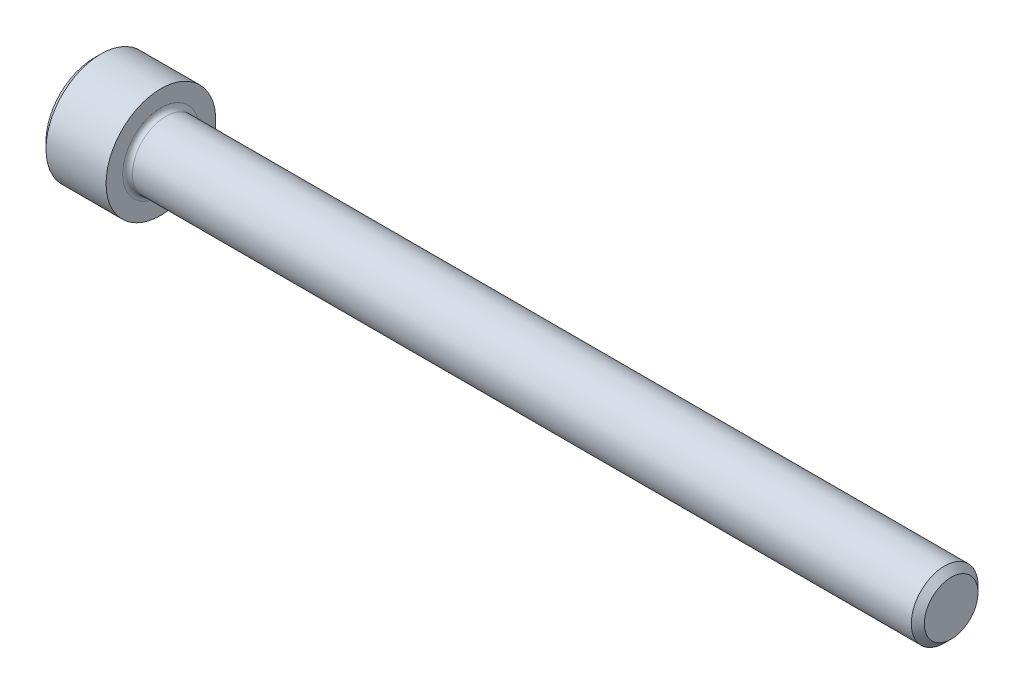
ISO-10303-21;
HEADER;
FILE_DESCRIPTION(('STEP AP214'),'2;1');
FILE_NAME('part.step','',(''),(''),'','','');
FILE_SCHEMA(('AUTOMOTIVE_DESIGN { 1 0 10303 214 1 1 1 1 }'));
ENDSEC;
DATA;
#1=APPLICATION_CONTEXT('core data for automotive mechanical design processes');
#2=APPLICATION_PROTOCOL_DEFINITION('international standard','automotive_design',2000,#1);
#3=PRODUCT_CONTEXT('',#1,'mechanical');
#4=PRODUCT('Part','Part','',(#3));
#5=PRODUCT_RELATED_PRODUCT_CATEGORY('part','',(#4));
#6=PRODUCT_DEFINITION_FORMATION('','',#4);
#7=PRODUCT_DEFINITION_CONTEXT('part definition',#1,'design');
#8=PRODUCT_DEFINITION('design','',#6,#7);
#9=PRODUCT_DEFINITION_SHAPE('','',#8);
#10=(LENGTH_UNIT() NAMED_UNIT(*) SI_UNIT(.MILLI.,.METRE.));
#11=(NAMED_UNIT(*) PLANE_ANGLE_UNIT() SI_UNIT($,.RADIAN.));
#12=(NAMED_UNIT(*) SI_UNIT($,.STERADIAN.) SOLID_ANGLE_UNIT());
#13=UNCERTAINTY_MEASURE_WITH_UNIT(LENGTH_MEASURE(1.E-05),#10,'distance_accuracy_value','');
#14=(GEOMETRIC_REPRESENTATION_CONTEXT(3) GLOBAL_UNCERTAINTY_ASSIGNED_CONTEXT((#13)) GLOBAL_UNIT_ASSIGNED_CONTEXT((#10,
#11,#12)) REPRESENTATION_CONTEXT('',''));
#15=CARTESIAN_POINT('',(0.,0.,0.));
#16=DIRECTION('',(0.,0.,1.));
#17=DIRECTION('',(1.,0.,0.));
#18=AXIS2_PLACEMENT_3D('',#15,#16,#17);
#19=CARTESIAN_POINT('',(2.286,1.14604605784412,1.98501000000003));
#20=DIRECTION('',(-1.,0.,0.));
#21=DIRECTION('',(0.,0.,1.));
#22=AXIS2_PLACEMENT_3D('',#19,#20,#21);
#23=PLANE('',#22);
#24=DIRECTION('',(0.,0.499999999999999,0.866025403784439));
#25=VECTOR('',#24,1.);
#26=CARTESIAN_POINT('',(2.286,-1.71906908676612,0.992505000000032));
#27=LINE('',#26,#25);
#28=CARTESIAN_POINT('',(2.28600000001322,-1.71906908676548,0.992504999999662));
#29=VERTEX_POINT('',#28);
#30=CARTESIAN_POINT('',(2.286,-1.14604605784409,1.98501));
#31=VERTEX_POINT('',#30);
#32=EDGE_CURVE('E100',#29,#31,#27,.T.);
#33=ORIENTED_EDGE('',*,*,#32,.T.);
#34=DIRECTION('',(0.,1.,0.));
#35=VECTOR('',#34,1.);
#36=CARTESIAN_POINT('',(2.286,1.14604605784412,1.98501));
#37=LINE('',#36,#35);
#38=CARTESIAN_POINT('',(2.28599999999801,0.,1.98501000002693));
#39=VERTEX_POINT('',#38);
#40=EDGE_CURVE('E95',#31,#39,#37,.T.);
#41=ORIENTED_EDGE('',*,*,#40,.T.);
#42=CARTESIAN_POINT('',(2.28600000002643,0.,0.));
#43=DIRECTION('',(-1.,0.,0.));
#44=DIRECTION('',(0.,0.,1.));
#45=AXIS2_PLACEMENT_3D('',#42,#43,#44);
#46=CIRCLE('',#45,1.98500999999851);
#47=EDGE_CURVE('E97',#39,#29,#46,.F.);
#48=ORIENTED_EDGE('',*,*,#47,.T.);
#49=EDGE_LOOP('',(#33,#41,#48));
#50=FACE_BOUND('',#49,.T.);
#51=ADVANCED_FACE('F17',(#50),#23,.T.);
#52=CARTESIAN_POINT('',(2.286,1.14604605784412,1.98501000000003));
#53=DIRECTION('',(-1.,0.,0.));
#54=DIRECTION('',(0.,0.,1.));
#55=AXIS2_PLACEMENT_3D('',#52,#53,#54);
#56=PLANE('',#55);
#57=DIRECTION('',(0.,-0.499999999999978,0.866025403784451));
#58=VECTOR('',#57,1.);
#59=CARTESIAN_POINT('',(2.286,-1.71906908676615,-0.992504999999998));
#60=LINE('',#59,#58);
#61=CARTESIAN_POINT('',(2.28600000001322,-1.7190690867655,-0.992504999999627));
#62=VERTEX_POINT('',#61);
#63=CARTESIAN_POINT('',(2.286,-2.2920921156882,0.));
#64=VERTEX_POINT('',#63);
#65=EDGE_CURVE('E104',#62,#64,#60,.T.);
#66=ORIENTED_EDGE('',*,*,#65,.T.);
#67=DIRECTION('',(0.,0.500000000000031,0.866025403784421));
#68=VECTOR('',#67,1.);
#69=CARTESIAN_POINT('',(2.286,-2.2920921156882,0.));
#70=LINE('',#69,#68);
#71=EDGE_CURVE('E171',#64,#29,#70,.T.);
#72=ORIENTED_EDGE('',*,*,#71,.T.);
#73=CARTESIAN_POINT('',(2.28600000002643,0.,0.));
#74=DIRECTION('',(-1.,0.,0.));
#75=DIRECTION('',(0.,0.,1.));
#76=AXIS2_PLACEMENT_3D('',#73,#74,#75);
#77=CIRCLE('',#76,1.98500999999851);
#78=EDGE_CURVE('E116',#29,#62,#77,.F.);
#79=ORIENTED_EDGE('',*,*,#78,.T.);
#80=EDGE_LOOP('',(#66,#72,#79));
#81=FACE_BOUND('',#80,.T.);
#82=ADVANCED_FACE('F228',(#81),#56,.T.);
#83=CARTESIAN_POINT('',(2.286,1.14604605784412,1.98501000000003));
#84=DIRECTION('',(-1.,0.,0.));
#85=DIRECTION('',(0.,0.,1.));
#86=AXIS2_PLACEMENT_3D('',#83,#84,#85);
#87=PLANE('',#86);
#88=DIRECTION('',(0.,1.,0.));
#89=VECTOR('',#88,1.);
#90=CARTESIAN_POINT('',(2.286,1.14604605784412,-1.98500999999998));
#91=LINE('',#90,#89);
#92=CARTESIAN_POINT('',(2.28600000002082,-3.05260855546239E-12,-1.98500999995698));
#93=VERTEX_POINT('',#92);
#94=CARTESIAN_POINT('',(2.286,-1.1460460578441,-1.98500999999998));
#95=VERTEX_POINT('',#94);
#96=EDGE_CURVE('E166',#93,#95,#91,.F.);
#97=ORIENTED_EDGE('',*,*,#96,.T.);
#98=DIRECTION('',(0.,-0.500000000000002,0.866025403784438));
#99=VECTOR('',#98,1.);
#100=CARTESIAN_POINT('',(2.286,-1.1460460578441,-1.98501));
#101=LINE('',#100,#99);
#102=EDGE_CURVE('E161',#95,#62,#101,.T.);
#103=ORIENTED_EDGE('',*,*,#102,.T.);
#104=CARTESIAN_POINT('',(2.28600000002643,0.,0.));
#105=DIRECTION('',(-1.,0.,0.));
#106=DIRECTION('',(0.,0.,1.));
#107=AXIS2_PLACEMENT_3D('',#104,#105,#106);
#108=CIRCLE('',#107,1.98500999999851);
#109=EDGE_CURVE('E224',#62,#93,#108,.F.);
#110=ORIENTED_EDGE('',*,*,#109,.T.);
#111=EDGE_LOOP('',(#97,#103,#110));
#112=FACE_BOUND('',#111,.T.);
#113=ADVANCED_FACE('F230',(#112),#87,.T.);
#114=CARTESIAN_POINT('',(2.286,1.14604605784412,1.98501000000003));
#115=DIRECTION('',(-1.,0.,0.));
#116=DIRECTION('',(0.,0.,1.));
#117=AXIS2_PLACEMENT_3D('',#114,#115,#116);
#118=PLANE('',#117);
#119=DIRECTION('',(0.,-0.499999999999991,-0.866025403784444));
#120=VECTOR('',#119,1.);
#121=CARTESIAN_POINT('',(2.286,1.71906908676615,-0.992504999999987));
#122=LINE('',#121,#120);
#123=CARTESIAN_POINT('',(2.28600000001321,1.71906908676551,-0.992504999999615));
#124=VERTEX_POINT('',#123);
#125=CARTESIAN_POINT('',(2.286,1.14604605784411,-1.98501));
#126=VERTEX_POINT('',#125);
#127=EDGE_CURVE('E156',#124,#126,#122,.T.);
#128=ORIENTED_EDGE('',*,*,#127,.T.);
#129=DIRECTION('',(0.,1.,0.));
#130=VECTOR('',#129,1.);
#131=CARTESIAN_POINT('',(2.286,1.14604605784412,-1.98501));
#132=LINE('',#131,#130);
#133=EDGE_CURVE('E151',#126,#93,#132,.F.);
#134=ORIENTED_EDGE('',*,*,#133,.T.);
#135=CARTESIAN_POINT('',(2.28600000002643,0.,0.));
#136=DIRECTION('',(-1.,0.,0.));
#137=DIRECTION('',(0.,0.,1.));
#138=AXIS2_PLACEMENT_3D('',#135,#136,#137);
#139=CIRCLE('',#138,1.98500999999851);
#140=EDGE_CURVE('E221',#93,#124,#139,.F.);
#141=ORIENTED_EDGE('',*,*,#140,.T.);
#142=EDGE_LOOP('',(#128,#134,#141));
#143=FACE_BOUND('',#142,.T.);
#144=ADVANCED_FACE('F235',(#143),#118,.T.);
#145=CARTESIAN_POINT('',(2.286,1.14604605784412,1.98501000000003));
#146=DIRECTION('',(-1.,0.,0.));
#147=DIRECTION('',(0.,0.,1.));
#148=AXIS2_PLACEMENT_3D('',#145,#146,#147);
#149=PLANE('',#148);
#150=DIRECTION('',(0.,0.500000000000002,-0.866025403784437));
#151=VECTOR('',#150,1.);
#152=CARTESIAN_POINT('',(2.286,1.71906908676615,0.992504999999998));
#153=LINE('',#152,#151);
#154=CARTESIAN_POINT('',(2.28600000001321,1.71906908676551,0.992504999999624));
#155=VERTEX_POINT('',#154);
#156=CARTESIAN_POINT('',(2.286,2.2920921156882,0.));
#157=VERTEX_POINT('',#156);
#158=EDGE_CURVE('E146',#155,#157,#153,.T.);
#159=ORIENTED_EDGE('',*,*,#158,.T.);
#160=DIRECTION('',(0.,-0.500000000000006,-0.866025403784435));
#161=VECTOR('',#160,1.);
#162=CARTESIAN_POINT('',(2.286,2.2920921156882,0.));
#163=LINE('',#162,#161);
#164=EDGE_CURVE('E117',#157,#124,#163,.T.);
#165=ORIENTED_EDGE('',*,*,#164,.T.);
#166=CARTESIAN_POINT('',(2.28600000002643,0.,0.));
#167=DIRECTION('',(-1.,0.,0.));
#168=DIRECTION('',(0.,0.,1.));
#169=AXIS2_PLACEMENT_3D('',#166,#167,#168);
#170=CIRCLE('',#169,1.98500999999851);
#171=EDGE_CURVE('E124',#124,#155,#170,.F.);
#172=ORIENTED_EDGE('',*,*,#171,.T.);
#173=EDGE_LOOP('',(#159,#165,#172));
#174=FACE_BOUND('',#173,.T.);
#175=ADVANCED_FACE('F237',(#174),#149,.T.);
#176=CARTESIAN_POINT('',(2.28600000002643,0.,0.));
#177=DIRECTION('',(-1.,0.,0.));
#178=DIRECTION('',(0.,0.,1.));
#179=AXIS2_PLACEMENT_3D('',#176,#177,#178);
#180=CONICAL_SURFACE('',#179,1.98500999999851,1.04719755110507);
#181=CARTESIAN_POINT('',(3.43204605775327,0.,1.70530256582424E-10));
#182=VERTEX_POINT('',#181);
#183=VERTEX_LOOP('',#182);
#184=FACE_BOUND('',#183,.T.);
#185=ORIENTED_EDGE('',*,*,#47,.F.);
#186=CARTESIAN_POINT('',(2.28600000002643,0.,0.));
#187=DIRECTION('',(-1.,0.,0.));
#188=DIRECTION('',(0.,0.,1.));
#189=AXIS2_PLACEMENT_3D('',#186,#187,#188);
#190=CIRCLE('',#189,1.98500999999851);
#191=EDGE_CURVE('E112',#155,#39,#190,.F.);
#192=ORIENTED_EDGE('',*,*,#191,.F.);
#193=ORIENTED_EDGE('',*,*,#171,.F.);
#194=ORIENTED_EDGE('',*,*,#140,.F.);
#195=ORIENTED_EDGE('',*,*,#109,.F.);
#196=ORIENTED_EDGE('',*,*,#78,.F.);
#197=EDGE_LOOP('',(#185,#192,#193,#194,#195,#196));
#198=FACE_BOUND('',#197,.T.);
#199=ADVANCED_FACE('F110',(#184,#198),#180,.F.);
#200=CARTESIAN_POINT('',(2.286,1.14604605784412,1.98501000000003));
#201=DIRECTION('',(-1.,0.,0.));
#202=DIRECTION('',(0.,0.,1.));
#203=AXIS2_PLACEMENT_3D('',#200,#201,#202);
#204=PLANE('',#203);
#205=DIRECTION('',(0.,-1.,0.));
#206=VECTOR('',#205,1.);
#207=CARTESIAN_POINT('',(2.286,-1.14604605784409,1.98501));
#208=LINE('',#207,#206);
#209=CARTESIAN_POINT('',(2.286,1.14604605784411,1.98501));
#210=VERTEX_POINT('',#209);
#211=EDGE_CURVE('E121',#39,#210,#208,.F.);
#212=ORIENTED_EDGE('',*,*,#211,.T.);
#213=DIRECTION('',(0.,0.500000000000002,-0.866025403784438));
#214=VECTOR('',#213,1.);
#215=CARTESIAN_POINT('',(2.286,2.2920921156882,0.));
#216=LINE('',#215,#214);
#217=EDGE_CURVE('E123',#155,#210,#216,.F.);
#218=ORIENTED_EDGE('',*,*,#217,.F.);
#219=ORIENTED_EDGE('',*,*,#191,.T.);
#220=EDGE_LOOP('',(#212,#218,#219));
#221=FACE_BOUND('',#220,.T.);
#222=ADVANCED_FACE('F120',(#221),#204,.T.);
#223=CARTESIAN_POINT('',(2.286,2.2920921156882,0.));
#224=DIRECTION('',(0.,-0.866025403784438,-0.500000000000002));
#225=DIRECTION('',(0.,0.500000000000002,-0.866025403784438));
#226=AXIS2_PLACEMENT_3D('',#223,#224,#225);
#227=PLANE('',#226);
#228=ORIENTED_EDGE('',*,*,#217,.T.);
#229=DIRECTION('',(1.,0.,0.));
#230=VECTOR('',#229,1.);
#231=CARTESIAN_POINT('',(2.286,1.14604605784412,1.98501));
#232=LINE('',#231,#230);
#233=CARTESIAN_POINT('',(0.,1.14604605784411,1.98501000000001));
#234=VERTEX_POINT('',#233);
#235=EDGE_CURVE('E129',#210,#234,#232,.F.);
#236=ORIENTED_EDGE('',*,*,#235,.T.);
#237=DIRECTION('',(0.,-0.499999999999992,0.866025403784443));
#238=VECTOR('',#237,1.);
#239=CARTESIAN_POINT('',(0.,2.2920921156882,0.));
#240=LINE('',#239,#238);
#241=CARTESIAN_POINT('',(0.,2.2920921156882,0.));
#242=VERTEX_POINT('',#241);
#243=EDGE_CURVE('E136',#242,#234,#240,.T.);
#244=ORIENTED_EDGE('',*,*,#243,.F.);
#245=DIRECTION('',(1.,0.,0.));
#246=VECTOR('',#245,1.);
#247=CARTESIAN_POINT('',(2.286,2.2920921156882,0.));
#248=LINE('',#247,#246);
#249=EDGE_CURVE('E186',#242,#157,#248,.T.);
#250=ORIENTED_EDGE('',*,*,#249,.T.);
#251=ORIENTED_EDGE('',*,*,#158,.F.);
#252=EDGE_LOOP('',(#228,#236,#244,#250,#251));
#253=FACE_BOUND('',#252,.T.);
#254=ADVANCED_FACE('F245',(#253),#227,.T.);
#255=CARTESIAN_POINT('',(2.286,-1.14604605784409,1.98501));
#256=DIRECTION('',(0.,0.,1.));
#257=DIRECTION('',(0.,-1.,0.));
#258=AXIS2_PLACEMENT_3D('',#255,#256,#257);
#259=PLANE('',#258);
#260=ORIENTED_EDGE('',*,*,#235,.F.);
#261=ORIENTED_EDGE('',*,*,#211,.F.);
#262=ORIENTED_EDGE('',*,*,#40,.F.);
#263=DIRECTION('',(1.,0.,0.));
#264=VECTOR('',#263,1.);
#265=CARTESIAN_POINT('',(2.286,-1.14604605784409,1.98501));
#266=LINE('',#265,#264);
#267=CARTESIAN_POINT('',(0.,-1.14604605784409,1.98501000000001));
#268=VERTEX_POINT('',#267);
#269=EDGE_CURVE('E131',#268,#31,#266,.T.);
#270=ORIENTED_EDGE('',*,*,#269,.F.);
#271=DIRECTION('',(0.,1.,0.));
#272=VECTOR('',#271,1.);
#273=CARTESIAN_POINT('',(0.,0.,1.98501000000002));
#274=LINE('',#273,#272);
#275=EDGE_CURVE('E249',#234,#268,#274,.F.);
#276=ORIENTED_EDGE('',*,*,#275,.F.);
#277=EDGE_LOOP('',(#260,#261,#262,#270,#276));
#278=FACE_BOUND('',#277,.T.);
#279=ADVANCED_FACE('F127',(#278),#259,.F.);
#280=CARTESIAN_POINT('',(2.286,-1.14604605784409,1.98501));
#281=DIRECTION('',(0.,0.866025403784437,-0.500000000000003));
#282=DIRECTION('',(0.,0.500000000000003,0.866025403784437));
#283=AXIS2_PLACEMENT_3D('',#280,#281,#282);
#284=PLANE('',#283);
#285=ORIENTED_EDGE('',*,*,#71,.F.);
#286=DIRECTION('',(1.,0.,0.));
#287=VECTOR('',#286,1.);
#288=CARTESIAN_POINT('',(2.286,-2.2920921156882,0.));
#289=LINE('',#288,#287);
#290=CARTESIAN_POINT('',(0.,-2.29209211568818,0.));
#291=VERTEX_POINT('',#290);
#292=EDGE_CURVE('E197',#291,#64,#289,.T.);
#293=ORIENTED_EDGE('',*,*,#292,.F.);
#294=DIRECTION('',(0.,-0.500000000000015,-0.86602540378443));
#295=VECTOR('',#294,1.);
#296=CARTESIAN_POINT('',(0.,-1.14604605784409,1.98501));
#297=LINE('',#296,#295);
#298=EDGE_CURVE('E250',#268,#291,#297,.T.);
#299=ORIENTED_EDGE('',*,*,#298,.F.);
#300=ORIENTED_EDGE('',*,*,#269,.T.);
#301=ORIENTED_EDGE('',*,*,#32,.F.);
#302=EDGE_LOOP('',(#285,#293,#299,#300,#301));
#303=FACE_BOUND('',#302,.T.);
#304=ADVANCED_FACE('F335',(#303),#284,.T.);
#305=CARTESIAN_POINT('',(2.286,-2.2920921156882,0.));
#306=DIRECTION('',(0.,0.866025403784437,0.500000000000002));
#307=DIRECTION('',(0.,-0.500000000000002,0.866025403784437));
#308=AXIS2_PLACEMENT_3D('',#305,#306,#307);
#309=PLANE('',#308);
#310=ORIENTED_EDGE('',*,*,#102,.F.);
#311=DIRECTION('',(1.,0.,0.));
#312=VECTOR('',#311,1.);
#313=CARTESIAN_POINT('',(2.286,-1.1460460578441,-1.98501));
#314=LINE('',#313,#312);
#315=CARTESIAN_POINT('',(0.,-1.14604605784408,-1.98500999999999));
#316=VERTEX_POINT('',#315);
#317=EDGE_CURVE('E190',#95,#316,#314,.F.);
#318=ORIENTED_EDGE('',*,*,#317,.T.);
#319=DIRECTION('',(0.,0.49999999999999,-0.866025403784444));
#320=VECTOR('',#319,1.);
#321=CARTESIAN_POINT('',(0.,-2.2920921156882,0.));
#322=LINE('',#321,#320);
#323=EDGE_CURVE('E252',#291,#316,#322,.T.);
#324=ORIENTED_EDGE('',*,*,#323,.F.);
#325=ORIENTED_EDGE('',*,*,#292,.T.);
#326=ORIENTED_EDGE('',*,*,#65,.F.);
#327=EDGE_LOOP('',(#310,#318,#324,#325,#326));
#328=FACE_BOUND('',#327,.T.);
#329=ADVANCED_FACE('F331',(#328),#309,.T.);
#330=CARTESIAN_POINT('',(2.286,1.14604605784411,-1.98501));
#331=DIRECTION('',(0.,0.,-1.));
#332=DIRECTION('',(0.,1.,0.));
#333=AXIS2_PLACEMENT_3D('',#330,#331,#332);
#334=PLANE('',#333);
#335=ORIENTED_EDGE('',*,*,#317,.F.);
#336=ORIENTED_EDGE('',*,*,#96,.F.);
#337=ORIENTED_EDGE('',*,*,#133,.F.);
#338=DIRECTION('',(1.,0.,0.));
#339=VECTOR('',#338,1.);
#340=CARTESIAN_POINT('',(2.286,1.1460460578441,-1.98501));
#341=LINE('',#340,#339);
#342=CARTESIAN_POINT('',(0.,1.14604605784411,-1.98501));
#343=VERTEX_POINT('',#342);
#344=EDGE_CURVE('E189',#126,#343,#341,.F.);
#345=ORIENTED_EDGE('',*,*,#344,.T.);
#346=DIRECTION('',(0.,1.,0.));
#347=VECTOR('',#346,1.);
#348=CARTESIAN_POINT('',(0.,0.,-1.98501));
#349=LINE('',#348,#347);
#350=EDGE_CURVE('E257',#316,#343,#349,.T.);
#351=ORIENTED_EDGE('',*,*,#350,.F.);
#352=EDGE_LOOP('',(#335,#336,#337,#345,#351));
#353=FACE_BOUND('',#352,.T.);
#354=ADVANCED_FACE('F328',(#353),#334,.F.);
#355=CARTESIAN_POINT('',(2.286,2.2920921156882,0.));
#356=DIRECTION('',(0.,0.866025403784437,-0.500000000000003));
#357=DIRECTION('',(0.,0.500000000000003,0.866025403784437));
#358=AXIS2_PLACEMENT_3D('',#355,#356,#357);
#359=PLANE('',#358);
#360=ORIENTED_EDGE('',*,*,#344,.F.);
#361=ORIENTED_EDGE('',*,*,#127,.F.);
#362=ORIENTED_EDGE('',*,*,#164,.F.);
#363=ORIENTED_EDGE('',*,*,#249,.F.);
#364=DIRECTION('',(0.,0.499999999999998,0.86602540378444));
#365=VECTOR('',#364,1.);
#366=CARTESIAN_POINT('',(0.,1.14604605784411,-1.98501));
#367=LINE('',#366,#365);
#368=EDGE_CURVE('E217',#343,#242,#367,.T.);
#369=ORIENTED_EDGE('',*,*,#368,.F.);
#370=EDGE_LOOP('',(#360,#361,#362,#363,#369));
#371=FACE_BOUND('',#370,.T.);
#372=ADVANCED_FACE('F241',(#371),#359,.F.);
#373=CARTESIAN_POINT('',(0.,0.,0.));
#374=DIRECTION('',(-1.,0.,0.));
#375=DIRECTION('',(0.,0.,1.));
#376=AXIS2_PLACEMENT_3D('',#373,#374,#375);
#377=PLANE('',#376);
#378=CARTESIAN_POINT('',(0.,0.,0.));
#379=DIRECTION('',(1.,0.,0.));
#380=DIRECTION('',(0.,0.,-1.));
#381=AXIS2_PLACEMENT_3D('',#378,#379,#380);
#382=CIRCLE('',#381,3.48615000001473);
#383=CARTESIAN_POINT('',(0.,0.,-3.48615000001473));
#384=VERTEX_POINT('',#383);
#385=EDGE_CURVE('E214',#384,#384,#382,.T.);
#386=ORIENTED_EDGE('',*,*,#385,.F.);
#387=EDGE_LOOP('',(#386));
#388=FACE_BOUND('',#387,.T.);
#389=ORIENTED_EDGE('',*,*,#350,.T.);
#390=ORIENTED_EDGE('',*,*,#368,.T.);
#391=ORIENTED_EDGE('',*,*,#243,.T.);
#392=ORIENTED_EDGE('',*,*,#275,.T.);
#393=ORIENTED_EDGE('',*,*,#298,.T.);
#394=ORIENTED_EDGE('',*,*,#323,.T.);
#395=EDGE_LOOP('',(#389,#390,#391,#392,#393,#394));
#396=FACE_BOUND('',#395,.T.);
#397=ADVANCED_FACE('F321',(#388,#396),#377,.T.);
#398=CARTESIAN_POINT('',(0.482599999998003,0.,0.));
#399=DIRECTION('',(1.,0.,0.));
#400=DIRECTION('',(0.,0.,-1.));
#401=AXIS2_PLACEMENT_3D('',#398,#399,#400);
#402=CONICAL_SURFACE('',#401,3.96875000001273,0.785398163397448);
#403=ORIENTED_EDGE('',*,*,#385,.T.);
#404=EDGE_LOOP('',(#403));
#405=FACE_BOUND('',#404,.T.);
#406=CARTESIAN_POINT('',(0.4826,0.,0.));
#407=DIRECTION('',(-1.,0.,0.));
#408=DIRECTION('',(0.,0.,1.));
#409=AXIS2_PLACEMENT_3D('',#406,#407,#408);
#410=CIRCLE('',#409,3.96875);
#411=CARTESIAN_POINT('',(0.482600000000001,0.,3.96874999999999));
#412=VERTEX_POINT('',#411);
#413=EDGE_CURVE('E216',#412,#412,#410,.F.);
#414=ORIENTED_EDGE('',*,*,#413,.F.);
#415=EDGE_LOOP('',(#414));
#416=FACE_BOUND('',#415,.T.);
#417=ADVANCED_FACE('F317',(#405,#416),#402,.T.);
#418=CARTESIAN_POINT('',(-31.75,0.,0.));
#419=DIRECTION('',(-1.,0.,0.));
#420=DIRECTION('',(0.,0.,1.));
#421=AXIS2_PLACEMENT_3D('',#418,#419,#420);
#422=CYLINDRICAL_SURFACE('',#421,3.96875);
#423=CARTESIAN_POINT('',(4.826,0.,0.));
#424=DIRECTION('',(-1.,0.,0.));
#425=DIRECTION('',(0.,0.,1.));
#426=AXIS2_PLACEMENT_3D('',#423,#424,#425);
#427=CIRCLE('',#426,3.96875);
#428=CARTESIAN_POINT('',(4.82600000000001,0.,3.96874999999999));
#429=VERTEX_POINT('',#428);
#430=EDGE_CURVE('E211',#429,#429,#427,.F.);
#431=ORIENTED_EDGE('',*,*,#430,.F.);
#432=EDGE_LOOP('',(#431));
#433=FACE_BOUND('',#432,.T.);
#434=ORIENTED_EDGE('',*,*,#413,.T.);
#435=EDGE_LOOP('',(#434));
#436=FACE_BOUND('',#435,.T.);
#437=ADVANCED_FACE('F313',(#433,#436),#422,.T.);
#438=CARTESIAN_POINT('',(61.976,1.94056,0.));
#439=DIRECTION('',(1.,0.,0.));
#440=DIRECTION('',(0.,0.,-1.));
#441=AXIS2_PLACEMENT_3D('',#438,#439,#440);
#442=PLANE('',#441);
#443=CARTESIAN_POINT('',(61.9760000000156,0.,0.));
#444=DIRECTION('',(-1.,0.,0.));
#445=DIRECTION('',(0.,0.,1.));
#446=AXIS2_PLACEMENT_3D('',#443,#444,#445);
#447=CIRCLE('',#446,1.94055999998);
#448=CARTESIAN_POINT('',(61.9760000000156,0.,1.94055999998));
#449=VERTEX_POINT('',#448);
#450=EDGE_CURVE('E207',#449,#449,#447,.T.);
#451=ORIENTED_EDGE('',*,*,#450,.F.);
#452=EDGE_LOOP('',(#451));
#453=FACE_BOUND('',#452,.T.);
#454=ADVANCED_FACE('F301',(#453),#442,.T.);
#455=CARTESIAN_POINT('',(4.826,3.96875000000002,0.));
#456=DIRECTION('',(1.,0.,0.));
#457=DIRECTION('',(0.,0.,-1.));
#458=AXIS2_PLACEMENT_3D('',#455,#456,#457);
#459=PLANE('',#458);
#460=ORIENTED_EDGE('',*,*,#430,.T.);
#461=EDGE_LOOP('',(#460));
#462=FACE_BOUND('',#461,.T.);
#463=CARTESIAN_POINT('',(4.826,0.,0.));
#464=DIRECTION('',(1.,0.,0.));
#465=DIRECTION('',(0.,0.,1.));
#466=AXIS2_PLACEMENT_3D('',#463,#464,#465);
#467=CIRCLE('',#466,2.76859999999998);
#468=CARTESIAN_POINT('',(4.826,0.,-2.76859999999998));
#469=VERTEX_POINT('',#468);
#470=CARTESIAN_POINT('',(4.826,0.,2.76859999999998));
#471=VERTEX_POINT('',#470);
#472=EDGE_CURVE('E210',#469,#471,#467,.F.);
#473=ORIENTED_EDGE('',*,*,#472,.T.);
#474=CARTESIAN_POINT('',(4.826,0.,0.));
#475=DIRECTION('',(1.,0.,0.));
#476=DIRECTION('',(0.,0.,-1.));
#477=AXIS2_PLACEMENT_3D('',#474,#475,#476);
#478=CIRCLE('',#477,2.76859999999998);
#479=EDGE_CURVE('E36',#471,#469,#478,.F.);
#480=ORIENTED_EDGE('',*,*,#479,.T.);
#481=EDGE_LOOP('',(#473,#480));
#482=FACE_BOUND('',#481,.T.);
#483=ADVANCED_FACE('F292',(#462,#482),#459,.T.);
#484=CARTESIAN_POINT('',(61.5035599999487,0.,0.));
#485=DIRECTION('',(-1.,0.,0.));
#486=DIRECTION('',(0.,0.,1.));
#487=AXIS2_PLACEMENT_3D('',#484,#485,#486);
#488=CONICAL_SURFACE('',#487,2.41300000004685,0.785398163397449);
#489=ORIENTED_EDGE('',*,*,#450,.T.);
#490=EDGE_LOOP('',(#489));
#491=FACE_BOUND('',#490,.T.);
#492=CARTESIAN_POINT('',(61.5035599999999,0.,0.));
#493=DIRECTION('',(-1.,0.,0.));
#494=DIRECTION('',(0.,0.,1.));
#495=AXIS2_PLACEMENT_3D('',#492,#493,#494);
#496=CIRCLE('',#495,2.41299999999998);
#497=CARTESIAN_POINT('',(61.5035599999999,0.,2.41299999999994));
#498=VERTEX_POINT('',#497);
#499=EDGE_CURVE('E28',#498,#498,#496,.T.);
#500=ORIENTED_EDGE('',*,*,#499,.F.);
#501=EDGE_LOOP('',(#500));
#502=FACE_BOUND('',#501,.T.);
#503=ADVANCED_FACE('F281',(#491,#502),#488,.T.);
#504=CARTESIAN_POINT('',(5.1816,0.,0.));
#505=DIRECTION('',(1.,0.,0.));
#506=DIRECTION('',(0.,0.,-1.));
#507=AXIS2_PLACEMENT_3D('',#504,#505,#506);
#508=TOROIDAL_SURFACE('',#507,2.76859999999998,0.3556);
#509=CARTESIAN_POINT('',(5.1816,0.,0.));
#510=DIRECTION('',(-1.,0.,0.));
#511=DIRECTION('',(0.,0.,1.));
#512=AXIS2_PLACEMENT_3D('',#509,#510,#511);
#513=CIRCLE('',#512,2.41299999999998);
#514=CARTESIAN_POINT('',(5.1816,0.,2.41299999999997));
#515=VERTEX_POINT('',#514);
#516=EDGE_CURVE('E11',#515,#515,#513,.F.);
#517=ORIENTED_EDGE('',*,*,#516,.F.);
#518=EDGE_LOOP('',(#517));
#519=FACE_BOUND('',#518,.T.);
#520=ORIENTED_EDGE('',*,*,#472,.F.);
#521=ORIENTED_EDGE('',*,*,#479,.F.);
#522=EDGE_LOOP('',(#520,#521));
#523=FACE_BOUND('',#522,.T.);
#524=ADVANCED_FACE('F269',(#519,#523),#508,.F.);
#525=CARTESIAN_POINT('',(-31.75,0.,0.));
#526=DIRECTION('',(-1.,0.,0.));
#527=DIRECTION('',(0.,0.,1.));
#528=AXIS2_PLACEMENT_3D('',#525,#526,#527);
#529=CYLINDRICAL_SURFACE('',#528,2.41299999999998);
#530=ORIENTED_EDGE('',*,*,#499,.T.);
#531=EDGE_LOOP('',(#530));
#532=FACE_BOUND('',#531,.T.);
#533=ORIENTED_EDGE('',*,*,#516,.T.);
#534=EDGE_LOOP('',(#533));
#535=FACE_BOUND('',#534,.T.);
#536=ADVANCED_FACE('F280',(#532,#535),#529,.T.);
#537=CLOSED_SHELL('',(#51,#82,#113,#144,#175,#199,#222,#254,#279,#304,#329,#354,#372,#397,#417,
#437,#454,#483,#503,#524,#536));
#538=MANIFOLD_SOLID_BREP('B1',#537);
#539=ADVANCED_BREP_SHAPE_REPRESENTATION('',(#18,#538),#14);
#540=SHAPE_DEFINITION_REPRESENTATION(#9,#539);
ENDSEC;
END-ISO-10303-21;
